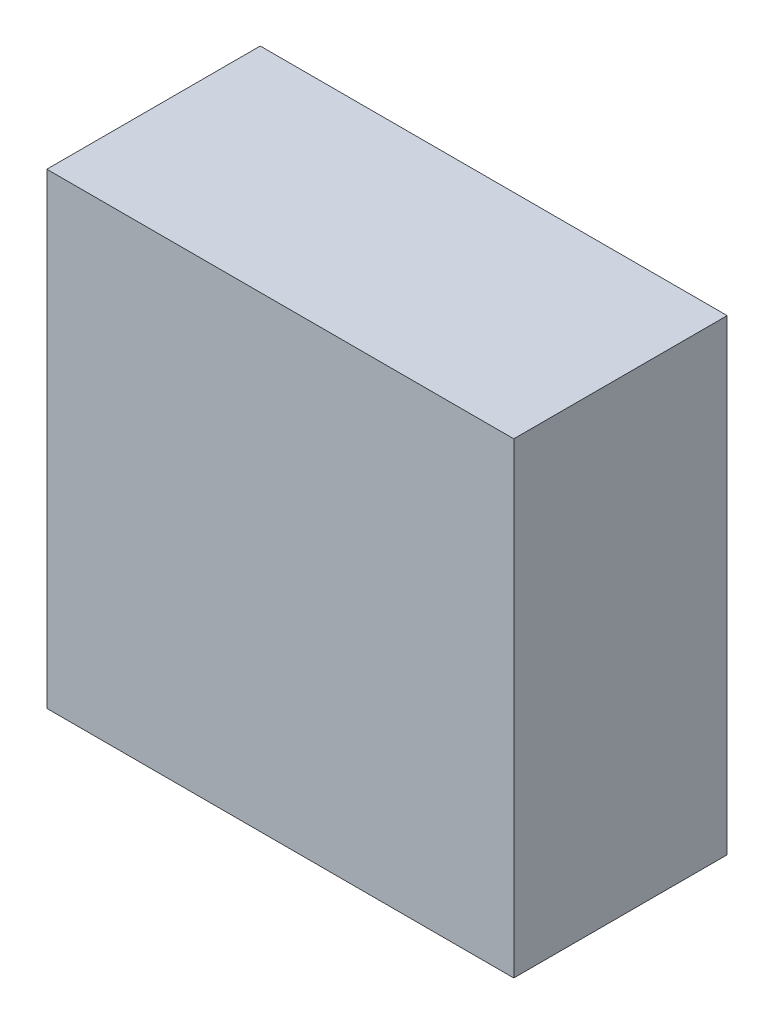
ISO-10303-21;
HEADER;
FILE_DESCRIPTION(('STEP AP214'),'2;1');
FILE_NAME('part.step','',(''),(''),'','','');
FILE_SCHEMA(('AUTOMOTIVE_DESIGN { 1 0 10303 214 1 1 1 1 }'));
ENDSEC;
DATA;
#1=APPLICATION_CONTEXT('core data for automotive mechanical design processes');
#2=APPLICATION_PROTOCOL_DEFINITION('international standard','automotive_design',2000,#1);
#3=PRODUCT_CONTEXT('',#1,'mechanical');
#4=PRODUCT('Part','Part','',(#3));
#5=PRODUCT_RELATED_PRODUCT_CATEGORY('part','',(#4));
#6=PRODUCT_DEFINITION_FORMATION('','',#4);
#7=PRODUCT_DEFINITION_CONTEXT('part definition',#1,'design');
#8=PRODUCT_DEFINITION('design','',#6,#7);
#9=PRODUCT_DEFINITION_SHAPE('','',#8);
#10=(LENGTH_UNIT() NAMED_UNIT(*) SI_UNIT(.MILLI.,.METRE.));
#11=(NAMED_UNIT(*) PLANE_ANGLE_UNIT() SI_UNIT($,.RADIAN.));
#12=(NAMED_UNIT(*) SI_UNIT($,.STERADIAN.) SOLID_ANGLE_UNIT());
#13=UNCERTAINTY_MEASURE_WITH_UNIT(LENGTH_MEASURE(1.E-05),#10,'distance_accuracy_value','');
#14=(GEOMETRIC_REPRESENTATION_CONTEXT(3) GLOBAL_UNCERTAINTY_ASSIGNED_CONTEXT((#13)) GLOBAL_UNIT_ASSIGNED_CONTEXT((#10,
#11,#12)) REPRESENTATION_CONTEXT('',''));
#15=CARTESIAN_POINT('',(0.,0.,0.));
#16=DIRECTION('',(0.,0.,1.));
#17=DIRECTION('',(1.,0.,0.));
#18=AXIS2_PLACEMENT_3D('',#15,#16,#17);
#19=CARTESIAN_POINT('',(-5.00000016,-5.00000016,4.57000102));
#20=DIRECTION('',(0.,0.,-1.));
#21=DIRECTION('',(-1.,0.,0.));
#22=AXIS2_PLACEMENT_3D('',#19,#20,#21);
#23=PLANE('',#22);
#24=DIRECTION('',(0.,1.,0.));
#25=VECTOR('',#24,1.);
#26=CARTESIAN_POINT('',(5.00000016,-5.00000016,4.57000102));
#27=LINE('',#26,#25);
#28=CARTESIAN_POINT('',(5.00000016,-5.00000016,4.57000102));
#29=VERTEX_POINT('',#28);
#30=CARTESIAN_POINT('',(5.00000016,5.00000016,4.57000102));
#31=VERTEX_POINT('',#30);
#32=EDGE_CURVE('E54',#29,#31,#27,.T.);
#33=ORIENTED_EDGE('',*,*,#32,.T.);
#34=DIRECTION('',(1.,0.,0.));
#35=VECTOR('',#34,1.);
#36=CARTESIAN_POINT('',(5.00000016,5.00000016,4.57000102));
#37=LINE('',#36,#35);
#38=CARTESIAN_POINT('',(-5.00000016,5.00000016,4.57000102));
#39=VERTEX_POINT('',#38);
#40=EDGE_CURVE('E56',#31,#39,#37,.F.);
#41=ORIENTED_EDGE('',*,*,#40,.T.);
#42=DIRECTION('',(0.,1.,0.));
#43=VECTOR('',#42,1.);
#44=CARTESIAN_POINT('',(-5.00000016,5.00000016,4.57000102));
#45=LINE('',#44,#43);
#46=CARTESIAN_POINT('',(-5.00000016,-5.00000016,4.57000102));
#47=VERTEX_POINT('',#46);
#48=EDGE_CURVE('E19',#39,#47,#45,.F.);
#49=ORIENTED_EDGE('',*,*,#48,.T.);
#50=DIRECTION('',(1.,0.,0.));
#51=VECTOR('',#50,1.);
#52=CARTESIAN_POINT('',(-5.00000016,-5.00000016,4.57000102));
#53=LINE('',#52,#51);
#54=EDGE_CURVE('E79',#47,#29,#53,.T.);
#55=ORIENTED_EDGE('',*,*,#54,.T.);
#56=EDGE_LOOP('',(#33,#41,#49,#55));
#57=FACE_BOUND('',#56,.T.);
#58=ADVANCED_FACE('F16',(#57),#23,.F.);
#59=CARTESIAN_POINT('',(-5.00000016,5.00000016,0.));
#60=DIRECTION('',(1.,0.,0.));
#61=DIRECTION('',(0.,0.,-1.));
#62=AXIS2_PLACEMENT_3D('',#59,#60,#61);
#63=PLANE('',#62);
#64=DIRECTION('',(0.,0.,1.));
#65=VECTOR('',#64,1.);
#66=CARTESIAN_POINT('',(-5.00000016,-5.00000016,0.));
#67=LINE('',#66,#65);
#68=CARTESIAN_POINT('',(-5.00000016,-5.00000016,0.));
#69=VERTEX_POINT('',#68);
#70=EDGE_CURVE('E67',#69,#47,#67,.T.);
#71=ORIENTED_EDGE('',*,*,#70,.T.);
#72=ORIENTED_EDGE('',*,*,#48,.F.);
#73=DIRECTION('',(0.,0.,-1.));
#74=VECTOR('',#73,1.);
#75=CARTESIAN_POINT('',(-5.00000016,5.00000016,0.));
#76=LINE('',#75,#74);
#77=CARTESIAN_POINT('',(-5.00000016,5.00000016,0.));
#78=VERTEX_POINT('',#77);
#79=EDGE_CURVE('E62',#39,#78,#76,.T.);
#80=ORIENTED_EDGE('',*,*,#79,.T.);
#81=DIRECTION('',(0.,1.,0.));
#82=VECTOR('',#81,1.);
#83=CARTESIAN_POINT('',(-5.00000016,-5.00000016,0.));
#84=LINE('',#83,#82);
#85=EDGE_CURVE('E82',#69,#78,#84,.T.);
#86=ORIENTED_EDGE('',*,*,#85,.F.);
#87=EDGE_LOOP('',(#71,#72,#80,#86));
#88=FACE_BOUND('',#87,.T.);
#89=ADVANCED_FACE('F64',(#88),#63,.F.);
#90=CARTESIAN_POINT('',(5.00000016,5.00000016,0.));
#91=DIRECTION('',(0.,-1.,0.));
#92=DIRECTION('',(0.,0.,-1.));
#93=AXIS2_PLACEMENT_3D('',#90,#91,#92);
#94=PLANE('',#93);
#95=ORIENTED_EDGE('',*,*,#79,.F.);
#96=ORIENTED_EDGE('',*,*,#40,.F.);
#97=DIRECTION('',(0.,0.,1.));
#98=VECTOR('',#97,1.);
#99=CARTESIAN_POINT('',(5.00000016,5.00000016,0.));
#100=LINE('',#99,#98);
#101=CARTESIAN_POINT('',(5.00000016,5.00000016,0.));
#102=VERTEX_POINT('',#101);
#103=EDGE_CURVE('E74',#31,#102,#100,.F.);
#104=ORIENTED_EDGE('',*,*,#103,.T.);
#105=DIRECTION('',(-1.,0.,0.));
#106=VECTOR('',#105,1.);
#107=CARTESIAN_POINT('',(-5.00000016,5.00000016,0.));
#108=LINE('',#107,#106);
#109=EDGE_CURVE('E71',#78,#102,#108,.F.);
#110=ORIENTED_EDGE('',*,*,#109,.F.);
#111=EDGE_LOOP('',(#95,#96,#104,#110));
#112=FACE_BOUND('',#111,.T.);
#113=ADVANCED_FACE('F69',(#112),#94,.F.);
#114=CARTESIAN_POINT('',(5.00000016,-5.00000016,0.));
#115=DIRECTION('',(-1.,0.,0.));
#116=DIRECTION('',(0.,0.,1.));
#117=AXIS2_PLACEMENT_3D('',#114,#115,#116);
#118=PLANE('',#117);
#119=ORIENTED_EDGE('',*,*,#103,.F.);
#120=ORIENTED_EDGE('',*,*,#32,.F.);
#121=DIRECTION('',(0.,0.,1.));
#122=VECTOR('',#121,1.);
#123=CARTESIAN_POINT('',(5.00000016,-5.00000016,0.));
#124=LINE('',#123,#122);
#125=CARTESIAN_POINT('',(5.00000016,-5.00000016,0.));
#126=VERTEX_POINT('',#125);
#127=EDGE_CURVE('E34',#29,#126,#124,.F.);
#128=ORIENTED_EDGE('',*,*,#127,.T.);
#129=DIRECTION('',(0.,1.,0.));
#130=VECTOR('',#129,1.);
#131=CARTESIAN_POINT('',(5.00000016,-5.00000016,0.));
#132=LINE('',#131,#130);
#133=EDGE_CURVE('E25',#102,#126,#132,.F.);
#134=ORIENTED_EDGE('',*,*,#133,.F.);
#135=EDGE_LOOP('',(#119,#120,#128,#134));
#136=FACE_BOUND('',#135,.T.);
#137=ADVANCED_FACE('F88',(#136),#118,.F.);
#138=CARTESIAN_POINT('',(-5.00000016,-5.00000016,0.));
#139=DIRECTION('',(0.,1.,0.));
#140=DIRECTION('',(0.,0.,1.));
#141=AXIS2_PLACEMENT_3D('',#138,#139,#140);
#142=PLANE('',#141);
#143=ORIENTED_EDGE('',*,*,#127,.F.);
#144=ORIENTED_EDGE('',*,*,#54,.F.);
#145=ORIENTED_EDGE('',*,*,#70,.F.);
#146=DIRECTION('',(-1.,0.,0.));
#147=VECTOR('',#146,1.);
#148=CARTESIAN_POINT('',(-5.00000016,-5.00000016,0.));
#149=LINE('',#148,#147);
#150=EDGE_CURVE('E10',#126,#69,#149,.T.);
#151=ORIENTED_EDGE('',*,*,#150,.F.);
#152=EDGE_LOOP('',(#143,#144,#145,#151));
#153=FACE_BOUND('',#152,.T.);
#154=ADVANCED_FACE('F90',(#153),#142,.F.);
#155=CARTESIAN_POINT('',(-5.00000016,-5.00000016,0.));
#156=DIRECTION('',(0.,0.,-1.));
#157=DIRECTION('',(-1.,0.,0.));
#158=AXIS2_PLACEMENT_3D('',#155,#156,#157);
#159=PLANE('',#158);
#160=ORIENTED_EDGE('',*,*,#133,.T.);
#161=ORIENTED_EDGE('',*,*,#150,.T.);
#162=ORIENTED_EDGE('',*,*,#85,.T.);
#163=ORIENTED_EDGE('',*,*,#109,.T.);
#164=EDGE_LOOP('',(#160,#161,#162,#163));
#165=FACE_BOUND('',#164,.T.);
#166=ADVANCED_FACE('F87',(#165),#159,.T.);
#167=CLOSED_SHELL('',(#58,#89,#113,#137,#154,#166));
#168=MANIFOLD_SOLID_BREP('B1',#167);
#169=ADVANCED_BREP_SHAPE_REPRESENTATION('',(#18,#168),#14);
#170=SHAPE_DEFINITION_REPRESENTATION(#9,#169);
ENDSEC;
END-ISO-10303-21;
